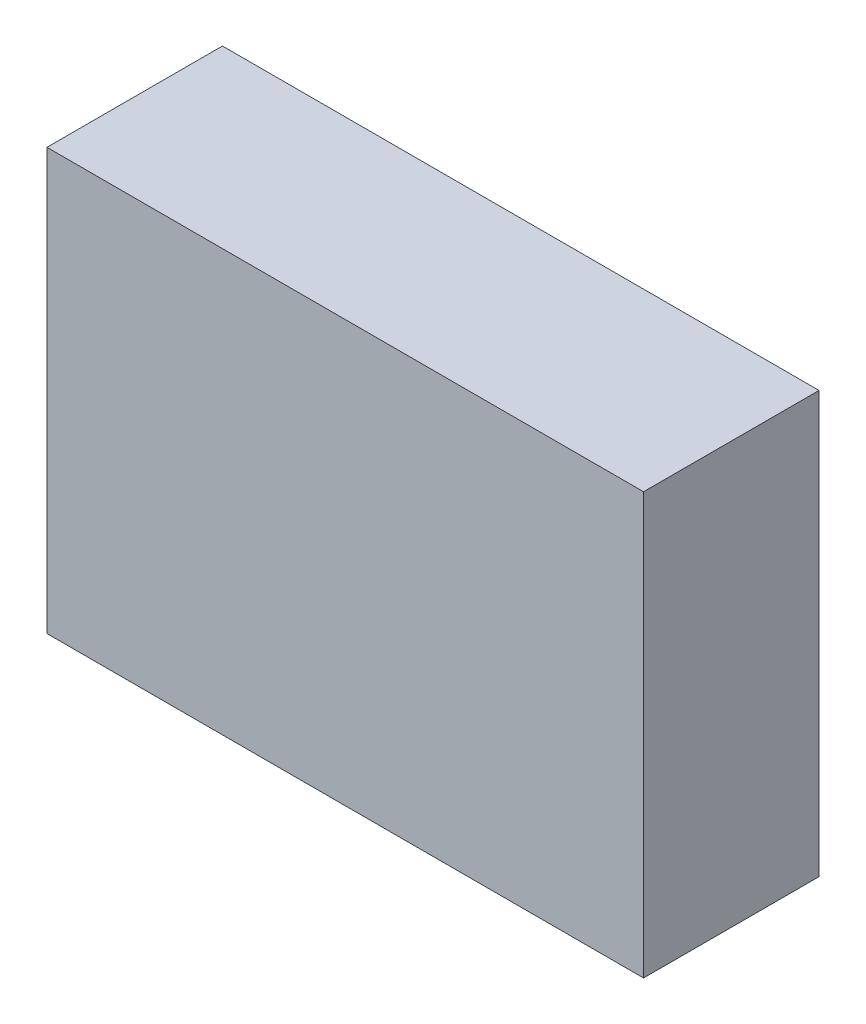
ISO-10303-21;
HEADER;
FILE_DESCRIPTION(('STEP AP214'),'2;1');
FILE_NAME('part.step','',(''),(''),'','','');
FILE_SCHEMA(('AUTOMOTIVE_DESIGN { 1 0 10303 214 1 1 1 1 }'));
ENDSEC;
DATA;
#1=APPLICATION_CONTEXT('core data for automotive mechanical design processes');
#2=APPLICATION_PROTOCOL_DEFINITION('international standard','automotive_design',2000,#1);
#3=PRODUCT_CONTEXT('',#1,'mechanical');
#4=PRODUCT('Part','Part','',(#3));
#5=PRODUCT_RELATED_PRODUCT_CATEGORY('part','',(#4));
#6=PRODUCT_DEFINITION_FORMATION('','',#4);
#7=PRODUCT_DEFINITION_CONTEXT('part definition',#1,'design');
#8=PRODUCT_DEFINITION('design','',#6,#7);
#9=PRODUCT_DEFINITION_SHAPE('','',#8);
#10=(LENGTH_UNIT() NAMED_UNIT(*) SI_UNIT(.MILLI.,.METRE.));
#11=(NAMED_UNIT(*) PLANE_ANGLE_UNIT() SI_UNIT($,.RADIAN.));
#12=(NAMED_UNIT(*) SI_UNIT($,.STERADIAN.) SOLID_ANGLE_UNIT());
#13=UNCERTAINTY_MEASURE_WITH_UNIT(LENGTH_MEASURE(1.E-05),#10,'distance_accuracy_value','');
#14=(GEOMETRIC_REPRESENTATION_CONTEXT(3) GLOBAL_UNCERTAINTY_ASSIGNED_CONTEXT((#13)) GLOBAL_UNIT_ASSIGNED_CONTEXT((#10,
#11,#12)) REPRESENTATION_CONTEXT('',''));
#15=CARTESIAN_POINT('',(0.,0.,0.));
#16=DIRECTION('',(0.,0.,1.));
#17=DIRECTION('',(1.,0.,0.));
#18=AXIS2_PLACEMENT_3D('',#15,#16,#17);
#19=CARTESIAN_POINT('',(2.58,-1.87,0.));
#20=DIRECTION('',(1.,0.,0.));
#21=DIRECTION('',(0.,0.,1.));
#22=AXIS2_PLACEMENT_3D('',#19,#20,#21);
#23=PLANE('',#22);
#24=DIRECTION('',(0.,1.,0.));
#25=VECTOR('',#24,1.);
#26=CARTESIAN_POINT('',(2.58,-1.87,0.1));
#27=LINE('',#26,#25);
#28=CARTESIAN_POINT('',(2.58,-1.87,0.1));
#29=VERTEX_POINT('',#28);
#30=CARTESIAN_POINT('',(2.58,-1.63,0.1));
#31=VERTEX_POINT('',#30);
#32=EDGE_CURVE('E11',#29,#31,#27,.T.);
#33=ORIENTED_EDGE('',*,*,#32,.T.);
#34=DIRECTION('',(0.,0.,1.));
#35=VECTOR('',#34,1.);
#36=CARTESIAN_POINT('',(2.58,-1.63,0.));
#37=LINE('',#36,#35);
#38=CARTESIAN_POINT('',(2.58,-1.63,0.));
#39=VERTEX_POINT('',#38);
#40=EDGE_CURVE('E24',#39,#31,#37,.T.);
#41=ORIENTED_EDGE('',*,*,#40,.F.);
#42=DIRECTION('',(0.,1.,0.));
#43=VECTOR('',#42,1.);
#44=CARTESIAN_POINT('',(2.58,-1.87,0.));
#45=LINE('',#44,#43);
#46=CARTESIAN_POINT('',(2.58,-1.87,0.));
#47=VERTEX_POINT('',#46);
#48=EDGE_CURVE('E86',#47,#39,#45,.T.);
#49=ORIENTED_EDGE('',*,*,#48,.F.);
#50=DIRECTION('',(0.,0.,1.));
#51=VECTOR('',#50,1.);
#52=CARTESIAN_POINT('',(2.58,-1.87,0.));
#53=LINE('',#52,#51);
#54=EDGE_CURVE('E36',#47,#29,#53,.T.);
#55=ORIENTED_EDGE('',*,*,#54,.T.);
#56=EDGE_LOOP('',(#33,#41,#49,#55));
#57=FACE_BOUND('',#56,.T.);
#58=ADVANCED_FACE('F17',(#57),#23,.F.);
#59=CARTESIAN_POINT('',(2.92,-1.87,0.));
#60=DIRECTION('',(1.,0.,0.));
#61=DIRECTION('',(0.,0.,1.));
#62=AXIS2_PLACEMENT_3D('',#59,#60,#61);
#63=PLANE('',#62);
#64=DIRECTION('',(0.,0.,1.));
#65=VECTOR('',#64,1.);
#66=CARTESIAN_POINT('',(2.92,-1.87,0.));
#67=LINE('',#66,#65);
#68=CARTESIAN_POINT('',(2.92,-1.87,0.));
#69=VERTEX_POINT('',#68);
#70=CARTESIAN_POINT('',(2.92,-1.87,0.1));
#71=VERTEX_POINT('',#70);
#72=EDGE_CURVE('E83',#69,#71,#67,.T.);
#73=ORIENTED_EDGE('',*,*,#72,.F.);
#74=DIRECTION('',(0.,1.,0.));
#75=VECTOR('',#74,1.);
#76=CARTESIAN_POINT('',(2.92,-1.87,0.));
#77=LINE('',#76,#75);
#78=CARTESIAN_POINT('',(2.92,-1.63,0.));
#79=VERTEX_POINT('',#78);
#80=EDGE_CURVE('E63',#69,#79,#77,.T.);
#81=ORIENTED_EDGE('',*,*,#80,.T.);
#82=DIRECTION('',(0.,0.,1.));
#83=VECTOR('',#82,1.);
#84=CARTESIAN_POINT('',(2.92,-1.63,0.));
#85=LINE('',#84,#83);
#86=CARTESIAN_POINT('',(2.92,-1.63,0.1));
#87=VERTEX_POINT('',#86);
#88=EDGE_CURVE('E57',#79,#87,#85,.T.);
#89=ORIENTED_EDGE('',*,*,#88,.T.);
#90=DIRECTION('',(0.,1.,0.));
#91=VECTOR('',#90,1.);
#92=CARTESIAN_POINT('',(2.92,-1.87,0.1));
#93=LINE('',#92,#91);
#94=EDGE_CURVE('E60',#71,#87,#93,.T.);
#95=ORIENTED_EDGE('',*,*,#94,.F.);
#96=EDGE_LOOP('',(#73,#81,#89,#95));
#97=FACE_BOUND('',#96,.T.);
#98=ADVANCED_FACE('F59',(#97),#63,.T.);
#99=CARTESIAN_POINT('',(2.58,-1.87,0.));
#100=DIRECTION('',(0.,1.,0.));
#101=DIRECTION('',(0.,0.,1.));
#102=AXIS2_PLACEMENT_3D('',#99,#100,#101);
#103=PLANE('',#102);
#104=ORIENTED_EDGE('',*,*,#72,.T.);
#105=DIRECTION('',(1.,0.,0.));
#106=VECTOR('',#105,1.);
#107=CARTESIAN_POINT('',(2.58,-1.87,0.1));
#108=LINE('',#107,#106);
#109=EDGE_CURVE('E71',#29,#71,#108,.T.);
#110=ORIENTED_EDGE('',*,*,#109,.F.);
#111=ORIENTED_EDGE('',*,*,#54,.F.);
#112=DIRECTION('',(1.,0.,0.));
#113=VECTOR('',#112,1.);
#114=CARTESIAN_POINT('',(2.58,-1.87,0.));
#115=LINE('',#114,#113);
#116=EDGE_CURVE('E76',#47,#69,#115,.T.);
#117=ORIENTED_EDGE('',*,*,#116,.T.);
#118=EDGE_LOOP('',(#104,#110,#111,#117));
#119=FACE_BOUND('',#118,.T.);
#120=ADVANCED_FACE('F91',(#119),#103,.F.);
#121=CARTESIAN_POINT('',(2.58,-1.63,0.));
#122=DIRECTION('',(0.,1.,0.));
#123=DIRECTION('',(0.,0.,1.));
#124=AXIS2_PLACEMENT_3D('',#121,#122,#123);
#125=PLANE('',#124);
#126=DIRECTION('',(1.,0.,0.));
#127=VECTOR('',#126,1.);
#128=CARTESIAN_POINT('',(2.58,-1.63,0.));
#129=LINE('',#128,#127);
#130=EDGE_CURVE('E74',#39,#79,#129,.T.);
#131=ORIENTED_EDGE('',*,*,#130,.F.);
#132=ORIENTED_EDGE('',*,*,#40,.T.);
#133=DIRECTION('',(1.,0.,0.));
#134=VECTOR('',#133,1.);
#135=CARTESIAN_POINT('',(2.58,-1.63,0.1));
#136=LINE('',#135,#134);
#137=EDGE_CURVE('E69',#31,#87,#136,.T.);
#138=ORIENTED_EDGE('',*,*,#137,.T.);
#139=ORIENTED_EDGE('',*,*,#88,.F.);
#140=EDGE_LOOP('',(#131,#132,#138,#139));
#141=FACE_BOUND('',#140,.T.);
#142=ADVANCED_FACE('F73',(#141),#125,.T.);
#143=CARTESIAN_POINT('',(2.58,-1.87,0.));
#144=DIRECTION('',(0.,0.,1.));
#145=DIRECTION('',(1.,0.,0.));
#146=AXIS2_PLACEMENT_3D('',#143,#144,#145);
#147=PLANE('',#146);
#148=ORIENTED_EDGE('',*,*,#130,.T.);
#149=ORIENTED_EDGE('',*,*,#80,.F.);
#150=ORIENTED_EDGE('',*,*,#116,.F.);
#151=ORIENTED_EDGE('',*,*,#48,.T.);
#152=EDGE_LOOP('',(#148,#149,#150,#151));
#153=FACE_BOUND('',#152,.T.);
#154=ADVANCED_FACE('F89',(#153),#147,.F.);
#155=CARTESIAN_POINT('',(2.58,-1.87,0.1));
#156=DIRECTION('',(0.,0.,1.));
#157=DIRECTION('',(1.,0.,0.));
#158=AXIS2_PLACEMENT_3D('',#155,#156,#157);
#159=PLANE('',#158);
#160=ORIENTED_EDGE('',*,*,#32,.F.);
#161=ORIENTED_EDGE('',*,*,#109,.T.);
#162=ORIENTED_EDGE('',*,*,#94,.T.);
#163=ORIENTED_EDGE('',*,*,#137,.F.);
#164=EDGE_LOOP('',(#160,#161,#162,#163));
#165=FACE_BOUND('',#164,.T.);
#166=ADVANCED_FACE('F68',(#165),#159,.T.);
#167=CLOSED_SHELL('',(#58,#98,#120,#142,#154,#166));
#168=MANIFOLD_SOLID_BREP('B1',#167);
#169=ADVANCED_BREP_SHAPE_REPRESENTATION('',(#18,#168),#14);
#170=SHAPE_DEFINITION_REPRESENTATION(#9,#169);
ENDSEC;
END-ISO-10303-21;
